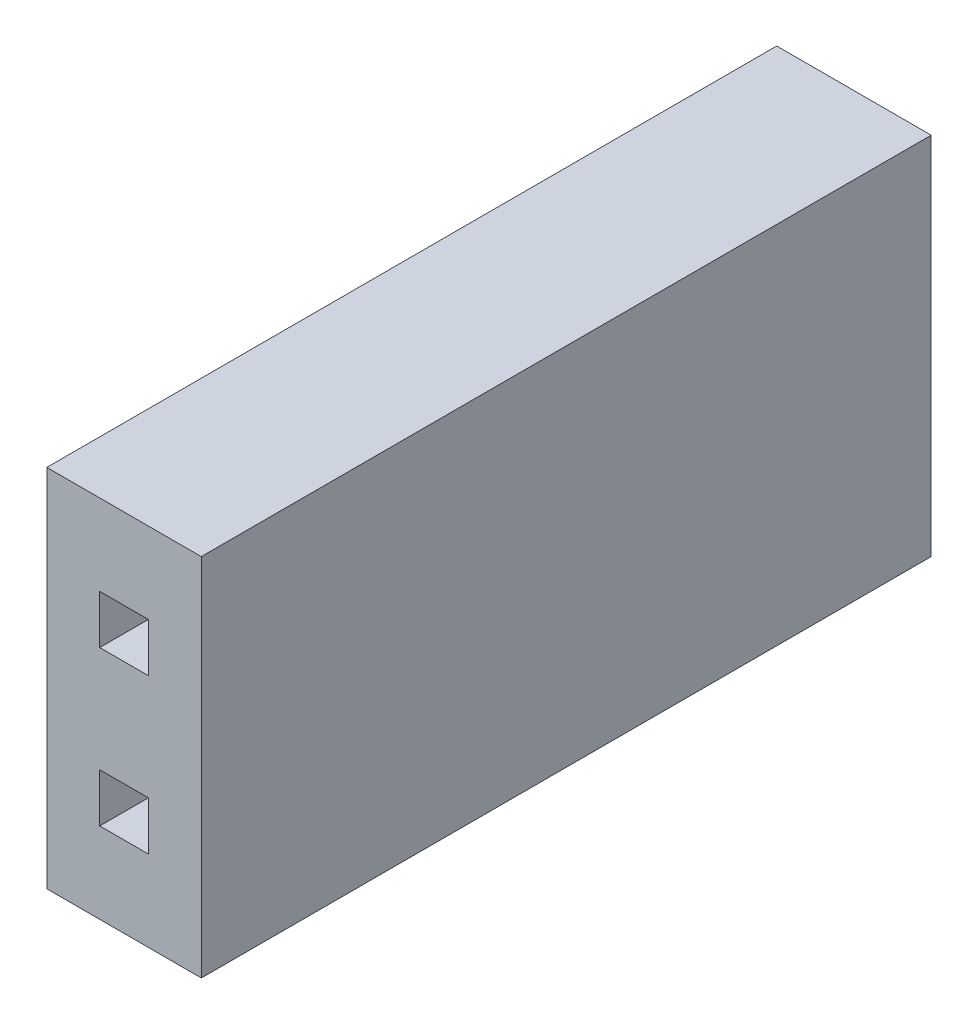
ISO-10303-21;
HEADER;
FILE_DESCRIPTION(('STEP AP214'),'2;1');
FILE_NAME('part.step','',(''),(''),'','','');
FILE_SCHEMA(('AUTOMOTIVE_DESIGN { 1 0 10303 214 1 1 1 1 }'));
ENDSEC;
DATA;
#1=APPLICATION_CONTEXT('core data for automotive mechanical design processes');
#2=APPLICATION_PROTOCOL_DEFINITION('international standard','automotive_design',2000,#1);
#3=PRODUCT_CONTEXT('',#1,'mechanical');
#4=PRODUCT('Part','Part','',(#3));
#5=PRODUCT_RELATED_PRODUCT_CATEGORY('part','',(#4));
#6=PRODUCT_DEFINITION_FORMATION('','',#4);
#7=PRODUCT_DEFINITION_CONTEXT('part definition',#1,'design');
#8=PRODUCT_DEFINITION('design','',#6,#7);
#9=PRODUCT_DEFINITION_SHAPE('','',#8);
#10=(LENGTH_UNIT() NAMED_UNIT(*) SI_UNIT(.MILLI.,.METRE.));
#11=(NAMED_UNIT(*) PLANE_ANGLE_UNIT() SI_UNIT($,.RADIAN.));
#12=(NAMED_UNIT(*) SI_UNIT($,.STERADIAN.) SOLID_ANGLE_UNIT());
#13=UNCERTAINTY_MEASURE_WITH_UNIT(LENGTH_MEASURE(1.E-05),#10,'distance_accuracy_value','');
#14=(GEOMETRIC_REPRESENTATION_CONTEXT(3) GLOBAL_UNCERTAINTY_ASSIGNED_CONTEXT((#13)) GLOBAL_UNIT_ASSIGNED_CONTEXT((#10,
#11,#12)) REPRESENTATION_CONTEXT('',''));
#15=CARTESIAN_POINT('',(0.,0.,0.));
#16=DIRECTION('',(0.,0.,1.));
#17=DIRECTION('',(1.,0.,0.));
#18=AXIS2_PLACEMENT_3D('',#15,#16,#17);
#19=CARTESIAN_POINT('',(0.,0.,12.));
#20=DIRECTION('',(1.,0.,0.));
#21=DIRECTION('',(0.,0.,-1.));
#22=AXIS2_PLACEMENT_3D('',#19,#20,#21);
#23=PLANE('',#22);
#24=DIRECTION('',(0.,-1.,0.));
#25=VECTOR('',#24,1.);
#26=CARTESIAN_POINT('',(0.,0.,0.));
#27=LINE('',#26,#25);
#28=CARTESIAN_POINT('',(0.,6.,0.));
#29=VERTEX_POINT('',#28);
#30=CARTESIAN_POINT('',(0.,0.,0.));
#31=VERTEX_POINT('',#30);
#32=EDGE_CURVE('E278',#29,#31,#27,.T.);
#33=ORIENTED_EDGE('',*,*,#32,.T.);
#34=DIRECTION('',(0.,0.,-1.));
#35=VECTOR('',#34,1.);
#36=CARTESIAN_POINT('',(0.,0.,12.));
#37=LINE('',#36,#35);
#38=CARTESIAN_POINT('',(0.,0.,12.));
#39=VERTEX_POINT('',#38);
#40=EDGE_CURVE('E11',#39,#31,#37,.T.);
#41=ORIENTED_EDGE('',*,*,#40,.F.);
#42=DIRECTION('',(0.,-1.,0.));
#43=VECTOR('',#42,1.);
#44=CARTESIAN_POINT('',(0.,0.,12.));
#45=LINE('',#44,#43);
#46=CARTESIAN_POINT('',(0.,6.,12.));
#47=VERTEX_POINT('',#46);
#48=EDGE_CURVE('E315',#47,#39,#45,.T.);
#49=ORIENTED_EDGE('',*,*,#48,.F.);
#50=DIRECTION('',(0.,0.,-1.));
#51=VECTOR('',#50,1.);
#52=CARTESIAN_POINT('',(0.,6.,12.));
#53=LINE('',#52,#51);
#54=EDGE_CURVE('E325',#47,#29,#53,.T.);
#55=ORIENTED_EDGE('',*,*,#54,.T.);
#56=EDGE_LOOP('',(#33,#41,#49,#55));
#57=FACE_BOUND('',#56,.T.);
#58=ADVANCED_FACE('F34',(#57),#23,.F.);
#59=CARTESIAN_POINT('',(0.,0.,12.));
#60=DIRECTION('',(0.,1.,0.));
#61=DIRECTION('',(0.,0.,1.));
#62=AXIS2_PLACEMENT_3D('',#59,#60,#61);
#63=PLANE('',#62);
#64=DIRECTION('',(1.,0.,0.));
#65=VECTOR('',#64,1.);
#66=CARTESIAN_POINT('',(0.,0.,0.));
#67=LINE('',#66,#65);
#68=CARTESIAN_POINT('',(2.54,0.,0.));
#69=VERTEX_POINT('',#68);
#70=EDGE_CURVE('E328',#31,#69,#67,.T.);
#71=ORIENTED_EDGE('',*,*,#70,.T.);
#72=DIRECTION('',(0.,0.,-1.));
#73=VECTOR('',#72,1.);
#74=CARTESIAN_POINT('',(2.54,0.,12.));
#75=LINE('',#74,#73);
#76=CARTESIAN_POINT('',(2.54,0.,12.));
#77=VERTEX_POINT('',#76);
#78=EDGE_CURVE('E41',#77,#69,#75,.T.);
#79=ORIENTED_EDGE('',*,*,#78,.F.);
#80=DIRECTION('',(1.,0.,0.));
#81=VECTOR('',#80,1.);
#82=CARTESIAN_POINT('',(0.,0.,12.));
#83=LINE('',#82,#81);
#84=EDGE_CURVE('E318',#39,#77,#83,.T.);
#85=ORIENTED_EDGE('',*,*,#84,.F.);
#86=ORIENTED_EDGE('',*,*,#40,.T.);
#87=EDGE_LOOP('',(#71,#79,#85,#86));
#88=FACE_BOUND('',#87,.T.);
#89=ADVANCED_FACE('F358',(#88),#63,.F.);
#90=CARTESIAN_POINT('',(2.54,0.,12.));
#91=DIRECTION('',(-1.,0.,0.));
#92=DIRECTION('',(0.,0.,1.));
#93=AXIS2_PLACEMENT_3D('',#90,#91,#92);
#94=PLANE('',#93);
#95=DIRECTION('',(0.,1.,0.));
#96=VECTOR('',#95,1.);
#97=CARTESIAN_POINT('',(2.54,0.,0.));
#98=LINE('',#97,#96);
#99=CARTESIAN_POINT('',(2.54,6.,0.));
#100=VERTEX_POINT('',#99);
#101=EDGE_CURVE('E330',#69,#100,#98,.T.);
#102=ORIENTED_EDGE('',*,*,#101,.T.);
#103=DIRECTION('',(0.,0.,-1.));
#104=VECTOR('',#103,1.);
#105=CARTESIAN_POINT('',(2.54,6.,12.));
#106=LINE('',#105,#104);
#107=CARTESIAN_POINT('',(2.54,6.,12.));
#108=VERTEX_POINT('',#107);
#109=EDGE_CURVE('E335',#108,#100,#106,.T.);
#110=ORIENTED_EDGE('',*,*,#109,.F.);
#111=DIRECTION('',(0.,1.,0.));
#112=VECTOR('',#111,1.);
#113=CARTESIAN_POINT('',(2.54,0.,12.));
#114=LINE('',#113,#112);
#115=EDGE_CURVE('E321',#77,#108,#114,.T.);
#116=ORIENTED_EDGE('',*,*,#115,.F.);
#117=ORIENTED_EDGE('',*,*,#78,.T.);
#118=EDGE_LOOP('',(#102,#110,#116,#117));
#119=FACE_BOUND('',#118,.T.);
#120=ADVANCED_FACE('F342',(#119),#94,.F.);
#121=CARTESIAN_POINT('',(0.,6.,12.));
#122=DIRECTION('',(0.,-1.,0.));
#123=DIRECTION('',(0.,0.,-1.));
#124=AXIS2_PLACEMENT_3D('',#121,#122,#123);
#125=PLANE('',#124);
#126=DIRECTION('',(-1.,0.,0.));
#127=VECTOR('',#126,1.);
#128=CARTESIAN_POINT('',(0.,6.,0.));
#129=LINE('',#128,#127);
#130=EDGE_CURVE('E319',#100,#29,#129,.T.);
#131=ORIENTED_EDGE('',*,*,#130,.T.);
#132=ORIENTED_EDGE('',*,*,#54,.F.);
#133=DIRECTION('',(-1.,0.,0.));
#134=VECTOR('',#133,1.);
#135=CARTESIAN_POINT('',(0.,6.,12.));
#136=LINE('',#135,#134);
#137=EDGE_CURVE('E323',#108,#47,#136,.T.);
#138=ORIENTED_EDGE('',*,*,#137,.F.);
#139=ORIENTED_EDGE('',*,*,#109,.T.);
#140=EDGE_LOOP('',(#131,#132,#138,#139));
#141=FACE_BOUND('',#140,.T.);
#142=ADVANCED_FACE('F351',(#141),#125,.F.);
#143=CARTESIAN_POINT('',(0.,0.,12.));
#144=DIRECTION('',(0.,0.,-1.));
#145=DIRECTION('',(-1.,0.,0.));
#146=AXIS2_PLACEMENT_3D('',#143,#144,#145);
#147=PLANE('',#146);
#148=DIRECTION('',(-1.,0.,0.));
#149=VECTOR('',#148,1.);
#150=CARTESIAN_POINT('',(0.87,4.67,12.));
#151=LINE('',#150,#149);
#152=CARTESIAN_POINT('',(1.67,4.67,12.));
#153=VERTEX_POINT('',#152);
#154=CARTESIAN_POINT('',(0.87,4.67,12.));
#155=VERTEX_POINT('',#154);
#156=EDGE_CURVE('E199',#153,#155,#151,.T.);
#157=ORIENTED_EDGE('',*,*,#156,.F.);
#158=DIRECTION('',(0.,1.,0.));
#159=VECTOR('',#158,1.);
#160=CARTESIAN_POINT('',(1.67,3.87,12.));
#161=LINE('',#160,#159);
#162=CARTESIAN_POINT('',(1.67,3.87,12.));
#163=VERTEX_POINT('',#162);
#164=EDGE_CURVE('E48',#163,#153,#161,.T.);
#165=ORIENTED_EDGE('',*,*,#164,.F.);
#166=DIRECTION('',(1.,0.,0.));
#167=VECTOR('',#166,1.);
#168=CARTESIAN_POINT('',(0.87,3.87,12.));
#169=LINE('',#168,#167);
#170=CARTESIAN_POINT('',(0.87,3.87,12.));
#171=VERTEX_POINT('',#170);
#172=EDGE_CURVE('E190',#171,#163,#169,.T.);
#173=ORIENTED_EDGE('',*,*,#172,.F.);
#174=DIRECTION('',(0.,-1.,0.));
#175=VECTOR('',#174,1.);
#176=CARTESIAN_POINT('',(0.87,3.87,12.));
#177=LINE('',#176,#175);
#178=EDGE_CURVE('E193',#155,#171,#177,.T.);
#179=ORIENTED_EDGE('',*,*,#178,.F.);
#180=EDGE_LOOP('',(#157,#165,#173,#179));
#181=FACE_BOUND('',#180,.T.);
#182=DIRECTION('',(-1.,0.,0.));
#183=VECTOR('',#182,1.);
#184=CARTESIAN_POINT('',(0.87,2.13,12.));
#185=LINE('',#184,#183);
#186=CARTESIAN_POINT('',(1.67,2.13,12.));
#187=VERTEX_POINT('',#186);
#188=CARTESIAN_POINT('',(0.87,2.13,12.));
#189=VERTEX_POINT('',#188);
#190=EDGE_CURVE('E225',#187,#189,#185,.T.);
#191=ORIENTED_EDGE('',*,*,#190,.F.);
#192=DIRECTION('',(0.,1.,0.));
#193=VECTOR('',#192,1.);
#194=CARTESIAN_POINT('',(1.67,1.33,12.));
#195=LINE('',#194,#193);
#196=CARTESIAN_POINT('',(1.67,1.33,12.));
#197=VERTEX_POINT('',#196);
#198=EDGE_CURVE('E56',#197,#187,#195,.T.);
#199=ORIENTED_EDGE('',*,*,#198,.F.);
#200=DIRECTION('',(1.,0.,0.));
#201=VECTOR('',#200,1.);
#202=CARTESIAN_POINT('',(0.87,1.33,12.));
#203=LINE('',#202,#201);
#204=CARTESIAN_POINT('',(0.87,1.33,12.));
#205=VERTEX_POINT('',#204);
#206=EDGE_CURVE('E214',#205,#197,#203,.T.);
#207=ORIENTED_EDGE('',*,*,#206,.F.);
#208=DIRECTION('',(0.,-1.,0.));
#209=VECTOR('',#208,1.);
#210=CARTESIAN_POINT('',(0.87,1.33,12.));
#211=LINE('',#210,#209);
#212=EDGE_CURVE('E228',#189,#205,#211,.T.);
#213=ORIENTED_EDGE('',*,*,#212,.F.);
#214=EDGE_LOOP('',(#191,#199,#207,#213));
#215=FACE_BOUND('',#214,.T.);
#216=ORIENTED_EDGE('',*,*,#48,.T.);
#217=ORIENTED_EDGE('',*,*,#84,.T.);
#218=ORIENTED_EDGE('',*,*,#115,.T.);
#219=ORIENTED_EDGE('',*,*,#137,.T.);
#220=EDGE_LOOP('',(#216,#217,#218,#219));
#221=FACE_BOUND('',#220,.T.);
#222=ADVANCED_FACE('F357',(#181,#215,#221),#147,.F.);
#223=CARTESIAN_POINT('',(0.,0.,0.));
#224=DIRECTION('',(0.,0.,-1.));
#225=DIRECTION('',(-1.,0.,0.));
#226=AXIS2_PLACEMENT_3D('',#223,#224,#225);
#227=PLANE('',#226);
#228=DIRECTION('',(0.,1.,0.));
#229=VECTOR('',#228,1.);
#230=CARTESIAN_POINT('',(0.270000000000001,5.27,0.));
#231=LINE('',#230,#229);
#232=CARTESIAN_POINT('',(0.27,3.27,0.));
#233=VERTEX_POINT('',#232);
#234=CARTESIAN_POINT('',(0.270000000000001,5.27,0.));
#235=VERTEX_POINT('',#234);
#236=EDGE_CURVE('E265',#233,#235,#231,.T.);
#237=ORIENTED_EDGE('',*,*,#236,.F.);
#238=DIRECTION('',(-1.,0.,0.));
#239=VECTOR('',#238,1.);
#240=CARTESIAN_POINT('',(2.27,3.27,0.));
#241=LINE('',#240,#239);
#242=CARTESIAN_POINT('',(2.27,3.27,0.));
#243=VERTEX_POINT('',#242);
#244=EDGE_CURVE('E255',#243,#233,#241,.T.);
#245=ORIENTED_EDGE('',*,*,#244,.F.);
#246=DIRECTION('',(0.,-1.,0.));
#247=VECTOR('',#246,1.);
#248=CARTESIAN_POINT('',(2.27,5.27,0.));
#249=LINE('',#248,#247);
#250=CARTESIAN_POINT('',(2.27,5.27,0.));
#251=VERTEX_POINT('',#250);
#252=EDGE_CURVE('E271',#251,#243,#249,.T.);
#253=ORIENTED_EDGE('',*,*,#252,.F.);
#254=DIRECTION('',(1.,0.,0.));
#255=VECTOR('',#254,1.);
#256=CARTESIAN_POINT('',(2.27,5.27,0.));
#257=LINE('',#256,#255);
#258=EDGE_CURVE('E267',#235,#251,#257,.T.);
#259=ORIENTED_EDGE('',*,*,#258,.F.);
#260=EDGE_LOOP('',(#237,#245,#253,#259));
#261=FACE_BOUND('',#260,.T.);
#262=DIRECTION('',(0.,1.,0.));
#263=VECTOR('',#262,1.);
#264=CARTESIAN_POINT('',(0.27,2.73,0.));
#265=LINE('',#264,#263);
#266=CARTESIAN_POINT('',(0.27,0.73,0.));
#267=VERTEX_POINT('',#266);
#268=CARTESIAN_POINT('',(0.27,2.73,0.));
#269=VERTEX_POINT('',#268);
#270=EDGE_CURVE('E250',#267,#269,#265,.T.);
#271=ORIENTED_EDGE('',*,*,#270,.F.);
#272=DIRECTION('',(-1.,0.,0.));
#273=VECTOR('',#272,1.);
#274=CARTESIAN_POINT('',(2.27,0.73,0.));
#275=LINE('',#274,#273);
#276=CARTESIAN_POINT('',(2.27,0.73,0.));
#277=VERTEX_POINT('',#276);
#278=EDGE_CURVE('E289',#277,#267,#275,.T.);
#279=ORIENTED_EDGE('',*,*,#278,.F.);
#280=DIRECTION('',(0.,-1.,0.));
#281=VECTOR('',#280,1.);
#282=CARTESIAN_POINT('',(2.27,2.73,0.));
#283=LINE('',#282,#281);
#284=CARTESIAN_POINT('',(2.27,2.73,0.));
#285=VERTEX_POINT('',#284);
#286=EDGE_CURVE('E303',#285,#277,#283,.T.);
#287=ORIENTED_EDGE('',*,*,#286,.F.);
#288=DIRECTION('',(1.,0.,0.));
#289=VECTOR('',#288,1.);
#290=CARTESIAN_POINT('',(2.27,2.73,0.));
#291=LINE('',#290,#289);
#292=EDGE_CURVE('E300',#269,#285,#291,.T.);
#293=ORIENTED_EDGE('',*,*,#292,.F.);
#294=EDGE_LOOP('',(#271,#279,#287,#293));
#295=FACE_BOUND('',#294,.T.);
#296=ORIENTED_EDGE('',*,*,#32,.F.);
#297=ORIENTED_EDGE('',*,*,#130,.F.);
#298=ORIENTED_EDGE('',*,*,#101,.F.);
#299=ORIENTED_EDGE('',*,*,#70,.F.);
#300=EDGE_LOOP('',(#296,#297,#298,#299));
#301=FACE_BOUND('',#300,.T.);
#302=ADVANCED_FACE('F348',(#261,#295,#301),#227,.T.);
#303=CARTESIAN_POINT('',(0.27,2.73,4.));
#304=DIRECTION('',(-1.,0.,0.));
#305=DIRECTION('',(0.,-1.,0.));
#306=AXIS2_PLACEMENT_3D('',#303,#304,#305);
#307=PLANE('',#306);
#308=ORIENTED_EDGE('',*,*,#270,.T.);
#309=DIRECTION('',(0.,0.,-1.));
#310=VECTOR('',#309,1.);
#311=CARTESIAN_POINT('',(0.27,2.73,4.));
#312=LINE('',#311,#310);
#313=CARTESIAN_POINT('',(0.27,2.73,4.));
#314=VERTEX_POINT('',#313);
#315=EDGE_CURVE('E298',#314,#269,#312,.T.);
#316=ORIENTED_EDGE('',*,*,#315,.F.);
#317=DIRECTION('',(0.,1.,0.));
#318=VECTOR('',#317,1.);
#319=CARTESIAN_POINT('',(0.27,2.73,4.));
#320=LINE('',#319,#318);
#321=CARTESIAN_POINT('',(0.27,0.73,4.));
#322=VERTEX_POINT('',#321);
#323=EDGE_CURVE('E285',#322,#314,#320,.T.);
#324=ORIENTED_EDGE('',*,*,#323,.F.);
#325=DIRECTION('',(0.,0.,-1.));
#326=VECTOR('',#325,1.);
#327=CARTESIAN_POINT('',(0.27,0.73,4.));
#328=LINE('',#327,#326);
#329=EDGE_CURVE('E268',#322,#267,#328,.T.);
#330=ORIENTED_EDGE('',*,*,#329,.T.);
#331=EDGE_LOOP('',(#308,#316,#324,#330));
#332=FACE_BOUND('',#331,.T.);
#333=ADVANCED_FACE('F370',(#332),#307,.F.);
#334=CARTESIAN_POINT('',(2.27,0.73,4.));
#335=DIRECTION('',(0.,-1.,0.));
#336=DIRECTION('',(0.,0.,-1.));
#337=AXIS2_PLACEMENT_3D('',#334,#335,#336);
#338=PLANE('',#337);
#339=ORIENTED_EDGE('',*,*,#278,.T.);
#340=ORIENTED_EDGE('',*,*,#329,.F.);
#341=DIRECTION('',(-1.,0.,0.));
#342=VECTOR('',#341,1.);
#343=CARTESIAN_POINT('',(2.27,0.73,4.));
#344=LINE('',#343,#342);
#345=CARTESIAN_POINT('',(2.27,0.73,4.));
#346=VERTEX_POINT('',#345);
#347=EDGE_CURVE('E295',#346,#322,#344,.T.);
#348=ORIENTED_EDGE('',*,*,#347,.F.);
#349=DIRECTION('',(0.,0.,-1.));
#350=VECTOR('',#349,1.);
#351=CARTESIAN_POINT('',(2.27,0.73,4.));
#352=LINE('',#351,#350);
#353=EDGE_CURVE('E309',#346,#277,#352,.T.);
#354=ORIENTED_EDGE('',*,*,#353,.T.);
#355=EDGE_LOOP('',(#339,#340,#348,#354));
#356=FACE_BOUND('',#355,.T.);
#357=ADVANCED_FACE('F377',(#356),#338,.F.);
#358=CARTESIAN_POINT('',(2.27,2.73,4.));
#359=DIRECTION('',(1.,0.,0.));
#360=DIRECTION('',(0.,1.,0.));
#361=AXIS2_PLACEMENT_3D('',#358,#359,#360);
#362=PLANE('',#361);
#363=ORIENTED_EDGE('',*,*,#286,.T.);
#364=ORIENTED_EDGE('',*,*,#353,.F.);
#365=DIRECTION('',(0.,-1.,0.));
#366=VECTOR('',#365,1.);
#367=CARTESIAN_POINT('',(2.27,2.73,4.));
#368=LINE('',#367,#366);
#369=CARTESIAN_POINT('',(2.27,2.73,4.));
#370=VERTEX_POINT('',#369);
#371=EDGE_CURVE('E292',#370,#346,#368,.T.);
#372=ORIENTED_EDGE('',*,*,#371,.F.);
#373=DIRECTION('',(0.,0.,-1.));
#374=VECTOR('',#373,1.);
#375=CARTESIAN_POINT('',(2.27,2.73,4.));
#376=LINE('',#375,#374);
#377=EDGE_CURVE('E311',#370,#285,#376,.T.);
#378=ORIENTED_EDGE('',*,*,#377,.T.);
#379=EDGE_LOOP('',(#363,#364,#372,#378));
#380=FACE_BOUND('',#379,.T.);
#381=ADVANCED_FACE('F383',(#380),#362,.F.);
#382=CARTESIAN_POINT('',(2.27,2.73,4.));
#383=DIRECTION('',(0.,1.,0.));
#384=DIRECTION('',(0.,0.,1.));
#385=AXIS2_PLACEMENT_3D('',#382,#383,#384);
#386=PLANE('',#385);
#387=ORIENTED_EDGE('',*,*,#292,.T.);
#388=ORIENTED_EDGE('',*,*,#377,.F.);
#389=DIRECTION('',(1.,0.,0.));
#390=VECTOR('',#389,1.);
#391=CARTESIAN_POINT('',(2.27,2.73,4.));
#392=LINE('',#391,#390);
#393=EDGE_CURVE('E288',#314,#370,#392,.T.);
#394=ORIENTED_EDGE('',*,*,#393,.F.);
#395=ORIENTED_EDGE('',*,*,#315,.T.);
#396=EDGE_LOOP('',(#387,#388,#394,#395));
#397=FACE_BOUND('',#396,.T.);
#398=ADVANCED_FACE('F379',(#397),#386,.F.);
#399=CARTESIAN_POINT('',(0.,0.,4.));
#400=DIRECTION('',(0.,0.,-1.));
#401=DIRECTION('',(-1.,0.,0.));
#402=AXIS2_PLACEMENT_3D('',#399,#400,#401);
#403=PLANE('',#402);
#404=CARTESIAN_POINT('',(1.27,1.73,4.));
#405=DIRECTION('',(0.,0.,-1.));
#406=DIRECTION('',(-1.,0.,0.));
#407=AXIS2_PLACEMENT_3D('',#404,#405,#406);
#408=CIRCLE('',#407,0.65);
#409=CARTESIAN_POINT('',(0.62,1.73,4.));
#410=VERTEX_POINT('',#409);
#411=EDGE_CURVE('E244',#410,#410,#408,.T.);
#412=ORIENTED_EDGE('',*,*,#411,.F.);
#413=EDGE_LOOP('',(#412));
#414=FACE_BOUND('',#413,.T.);
#415=ORIENTED_EDGE('',*,*,#323,.T.);
#416=ORIENTED_EDGE('',*,*,#393,.T.);
#417=ORIENTED_EDGE('',*,*,#371,.T.);
#418=ORIENTED_EDGE('',*,*,#347,.T.);
#419=EDGE_LOOP('',(#415,#416,#417,#418));
#420=FACE_BOUND('',#419,.T.);
#421=ADVANCED_FACE('F382',(#414,#420),#403,.T.);
#422=CARTESIAN_POINT('',(0.270000000000001,5.27,4.));
#423=DIRECTION('',(-1.,0.,0.));
#424=DIRECTION('',(0.,-1.,0.));
#425=AXIS2_PLACEMENT_3D('',#422,#423,#424);
#426=PLANE('',#425);
#427=ORIENTED_EDGE('',*,*,#236,.T.);
#428=DIRECTION('',(0.,0.,-1.));
#429=VECTOR('',#428,1.);
#430=CARTESIAN_POINT('',(0.270000000000001,5.27,4.));
#431=LINE('',#430,#429);
#432=CARTESIAN_POINT('',(0.270000000000001,5.27,4.));
#433=VERTEX_POINT('',#432);
#434=EDGE_CURVE('E264',#433,#235,#431,.T.);
#435=ORIENTED_EDGE('',*,*,#434,.F.);
#436=DIRECTION('',(0.,1.,0.));
#437=VECTOR('',#436,1.);
#438=CARTESIAN_POINT('',(0.270000000000001,5.27,4.));
#439=LINE('',#438,#437);
#440=CARTESIAN_POINT('',(0.27,3.27,4.));
#441=VERTEX_POINT('',#440);
#442=EDGE_CURVE('E251',#441,#433,#439,.T.);
#443=ORIENTED_EDGE('',*,*,#442,.F.);
#444=DIRECTION('',(0.,0.,-1.));
#445=VECTOR('',#444,1.);
#446=CARTESIAN_POINT('',(0.27,3.27,4.));
#447=LINE('',#446,#445);
#448=EDGE_CURVE('E276',#441,#233,#447,.T.);
#449=ORIENTED_EDGE('',*,*,#448,.T.);
#450=EDGE_LOOP('',(#427,#435,#443,#449));
#451=FACE_BOUND('',#450,.T.);
#452=ADVANCED_FACE('F393',(#451),#426,.F.);
#453=CARTESIAN_POINT('',(2.27,3.27,4.));
#454=DIRECTION('',(0.,-1.,0.));
#455=DIRECTION('',(0.,0.,-1.));
#456=AXIS2_PLACEMENT_3D('',#453,#454,#455);
#457=PLANE('',#456);
#458=ORIENTED_EDGE('',*,*,#244,.T.);
#459=ORIENTED_EDGE('',*,*,#448,.F.);
#460=DIRECTION('',(-1.,0.,0.));
#461=VECTOR('',#460,1.);
#462=CARTESIAN_POINT('',(2.27,3.27,4.));
#463=LINE('',#462,#461);
#464=CARTESIAN_POINT('',(2.27,3.27,4.));
#465=VERTEX_POINT('',#464);
#466=EDGE_CURVE('E261',#465,#441,#463,.T.);
#467=ORIENTED_EDGE('',*,*,#466,.F.);
#468=DIRECTION('',(0.,0.,-1.));
#469=VECTOR('',#468,1.);
#470=CARTESIAN_POINT('',(2.27,3.27,4.));
#471=LINE('',#470,#469);
#472=EDGE_CURVE('E279',#465,#243,#471,.T.);
#473=ORIENTED_EDGE('',*,*,#472,.T.);
#474=EDGE_LOOP('',(#458,#459,#467,#473));
#475=FACE_BOUND('',#474,.T.);
#476=ADVANCED_FACE('F397',(#475),#457,.F.);
#477=CARTESIAN_POINT('',(2.27,5.27,4.));
#478=DIRECTION('',(1.,0.,0.));
#479=DIRECTION('',(0.,0.,-1.));
#480=AXIS2_PLACEMENT_3D('',#477,#478,#479);
#481=PLANE('',#480);
#482=ORIENTED_EDGE('',*,*,#252,.T.);
#483=ORIENTED_EDGE('',*,*,#472,.F.);
#484=DIRECTION('',(0.,-1.,0.));
#485=VECTOR('',#484,1.);
#486=CARTESIAN_POINT('',(2.27,5.27,4.));
#487=LINE('',#486,#485);
#488=CARTESIAN_POINT('',(2.27,5.27,4.));
#489=VERTEX_POINT('',#488);
#490=EDGE_CURVE('E258',#489,#465,#487,.T.);
#491=ORIENTED_EDGE('',*,*,#490,.F.);
#492=DIRECTION('',(0.,0.,-1.));
#493=VECTOR('',#492,1.);
#494=CARTESIAN_POINT('',(2.27,5.27,4.));
#495=LINE('',#494,#493);
#496=EDGE_CURVE('E281',#489,#251,#495,.T.);
#497=ORIENTED_EDGE('',*,*,#496,.T.);
#498=EDGE_LOOP('',(#482,#483,#491,#497));
#499=FACE_BOUND('',#498,.T.);
#500=ADVANCED_FACE('F403',(#499),#481,.F.);
#501=CARTESIAN_POINT('',(2.27,5.27,4.));
#502=DIRECTION('',(0.,1.,0.));
#503=DIRECTION('',(0.,0.,1.));
#504=AXIS2_PLACEMENT_3D('',#501,#502,#503);
#505=PLANE('',#504);
#506=ORIENTED_EDGE('',*,*,#258,.T.);
#507=ORIENTED_EDGE('',*,*,#496,.F.);
#508=DIRECTION('',(1.,0.,0.));
#509=VECTOR('',#508,1.);
#510=CARTESIAN_POINT('',(2.27,5.27,4.));
#511=LINE('',#510,#509);
#512=EDGE_CURVE('E254',#433,#489,#511,.T.);
#513=ORIENTED_EDGE('',*,*,#512,.F.);
#514=ORIENTED_EDGE('',*,*,#434,.T.);
#515=EDGE_LOOP('',(#506,#507,#513,#514));
#516=FACE_BOUND('',#515,.T.);
#517=ADVANCED_FACE('F399',(#516),#505,.F.);
#518=CARTESIAN_POINT('',(0.,0.,4.));
#519=DIRECTION('',(0.,0.,-1.));
#520=DIRECTION('',(-1.,0.,0.));
#521=AXIS2_PLACEMENT_3D('',#518,#519,#520);
#522=PLANE('',#521);
#523=CARTESIAN_POINT('',(1.27,4.27,4.));
#524=DIRECTION('',(0.,0.,-1.));
#525=DIRECTION('',(-1.,0.,0.));
#526=AXIS2_PLACEMENT_3D('',#523,#524,#525);
#527=CIRCLE('',#526,0.65);
#528=CARTESIAN_POINT('',(0.62,4.27,4.));
#529=VERTEX_POINT('',#528);
#530=EDGE_CURVE('E206',#529,#529,#527,.T.);
#531=ORIENTED_EDGE('',*,*,#530,.F.);
#532=EDGE_LOOP('',(#531));
#533=FACE_BOUND('',#532,.T.);
#534=ORIENTED_EDGE('',*,*,#442,.T.);
#535=ORIENTED_EDGE('',*,*,#512,.T.);
#536=ORIENTED_EDGE('',*,*,#490,.T.);
#537=ORIENTED_EDGE('',*,*,#466,.T.);
#538=EDGE_LOOP('',(#534,#535,#536,#537));
#539=FACE_BOUND('',#538,.T.);
#540=ADVANCED_FACE('F402',(#533,#539),#522,.T.);
#541=CARTESIAN_POINT('',(1.27,1.73,-1.83847763108502));
#542=DIRECTION('',(0.,0.,1.));
#543=DIRECTION('',(1.,0.,0.));
#544=AXIS2_PLACEMENT_3D('',#541,#542,#543);
#545=CYLINDRICAL_SURFACE('',#544,0.65);
#546=ORIENTED_EDGE('',*,*,#411,.T.);
#547=EDGE_LOOP('',(#546));
#548=FACE_BOUND('',#547,.T.);
#549=CARTESIAN_POINT('',(1.27,1.73,0.));
#550=DIRECTION('',(0.,0.,-1.));
#551=DIRECTION('',(-1.,0.,0.));
#552=AXIS2_PLACEMENT_3D('',#549,#550,#551);
#553=CIRCLE('',#552,0.65);
#554=CARTESIAN_POINT('',(0.62,1.73,0.));
#555=VERTEX_POINT('',#554);
#556=EDGE_CURVE('E247',#555,#555,#553,.T.);
#557=ORIENTED_EDGE('',*,*,#556,.F.);
#558=EDGE_LOOP('',(#557));
#559=FACE_BOUND('',#558,.T.);
#560=ADVANCED_FACE('F413',(#548,#559),#545,.T.);
#561=CARTESIAN_POINT('',(0.,0.,0.));
#562=DIRECTION('',(0.,0.,-1.));
#563=DIRECTION('',(-1.,0.,0.));
#564=AXIS2_PLACEMENT_3D('',#561,#562,#563);
#565=PLANE('',#564);
#566=ORIENTED_EDGE('',*,*,#556,.T.);
#567=EDGE_LOOP('',(#566));
#568=FACE_BOUND('',#567,.T.);
#569=ADVANCED_FACE('F415',(#568),#565,.T.);
#570=CARTESIAN_POINT('',(1.27,4.27,-1.83847763108502));
#571=DIRECTION('',(0.,0.,1.));
#572=DIRECTION('',(1.,0.,0.));
#573=AXIS2_PLACEMENT_3D('',#570,#571,#572);
#574=CYLINDRICAL_SURFACE('',#573,0.65);
#575=ORIENTED_EDGE('',*,*,#530,.T.);
#576=EDGE_LOOP('',(#575));
#577=FACE_BOUND('',#576,.T.);
#578=CARTESIAN_POINT('',(1.27,4.27,0.));
#579=DIRECTION('',(0.,0.,-1.));
#580=DIRECTION('',(-1.,0.,0.));
#581=AXIS2_PLACEMENT_3D('',#578,#579,#580);
#582=CIRCLE('',#581,0.65);
#583=CARTESIAN_POINT('',(0.62,4.27,0.));
#584=VERTEX_POINT('',#583);
#585=EDGE_CURVE('E241',#584,#584,#582,.T.);
#586=ORIENTED_EDGE('',*,*,#585,.F.);
#587=EDGE_LOOP('',(#586));
#588=FACE_BOUND('',#587,.T.);
#589=ADVANCED_FACE('F418',(#577,#588),#574,.T.);
#590=CARTESIAN_POINT('',(0.,0.,0.));
#591=DIRECTION('',(0.,0.,-1.));
#592=DIRECTION('',(-1.,0.,0.));
#593=AXIS2_PLACEMENT_3D('',#590,#591,#592);
#594=PLANE('',#593);
#595=ORIENTED_EDGE('',*,*,#585,.T.);
#596=EDGE_LOOP('',(#595));
#597=FACE_BOUND('',#596,.T.);
#598=ADVANCED_FACE('F423',(#597),#594,.T.);
#599=CARTESIAN_POINT('',(1.67,1.33,7.));
#600=DIRECTION('',(1.,0.,0.));
#601=DIRECTION('',(0.,0.,-1.));
#602=AXIS2_PLACEMENT_3D('',#599,#600,#601);
#603=PLANE('',#602);
#604=ORIENTED_EDGE('',*,*,#198,.T.);
#605=DIRECTION('',(0.,0.,1.));
#606=VECTOR('',#605,1.);
#607=CARTESIAN_POINT('',(1.67,2.13,7.));
#608=LINE('',#607,#606);
#609=CARTESIAN_POINT('',(1.67,2.13,7.));
#610=VERTEX_POINT('',#609);
#611=EDGE_CURVE('E223',#610,#187,#608,.T.);
#612=ORIENTED_EDGE('',*,*,#611,.F.);
#613=DIRECTION('',(0.,1.,0.));
#614=VECTOR('',#613,1.);
#615=CARTESIAN_POINT('',(1.67,1.33,7.));
#616=LINE('',#615,#614);
#617=CARTESIAN_POINT('',(1.67,1.33,7.));
#618=VERTEX_POINT('',#617);
#619=EDGE_CURVE('E210',#618,#610,#616,.T.);
#620=ORIENTED_EDGE('',*,*,#619,.F.);
#621=DIRECTION('',(0.,0.,1.));
#622=VECTOR('',#621,1.);
#623=CARTESIAN_POINT('',(1.67,1.33,7.));
#624=LINE('',#623,#622);
#625=EDGE_CURVE('E200',#618,#197,#624,.T.);
#626=ORIENTED_EDGE('',*,*,#625,.T.);
#627=EDGE_LOOP('',(#604,#612,#620,#626));
#628=FACE_BOUND('',#627,.T.);
#629=ADVANCED_FACE('F426',(#628),#603,.F.);
#630=CARTESIAN_POINT('',(0.87,1.33,7.));
#631=DIRECTION('',(0.,-1.,0.));
#632=DIRECTION('',(0.,0.,-1.));
#633=AXIS2_PLACEMENT_3D('',#630,#631,#632);
#634=PLANE('',#633);
#635=ORIENTED_EDGE('',*,*,#206,.T.);
#636=ORIENTED_EDGE('',*,*,#625,.F.);
#637=DIRECTION('',(1.,0.,0.));
#638=VECTOR('',#637,1.);
#639=CARTESIAN_POINT('',(0.87,1.33,7.));
#640=LINE('',#639,#638);
#641=CARTESIAN_POINT('',(0.87,1.33,7.));
#642=VERTEX_POINT('',#641);
#643=EDGE_CURVE('E220',#642,#618,#640,.T.);
#644=ORIENTED_EDGE('',*,*,#643,.F.);
#645=DIRECTION('',(0.,0.,1.));
#646=VECTOR('',#645,1.);
#647=CARTESIAN_POINT('',(0.87,1.33,7.));
#648=LINE('',#647,#646);
#649=EDGE_CURVE('E234',#642,#205,#648,.T.);
#650=ORIENTED_EDGE('',*,*,#649,.T.);
#651=EDGE_LOOP('',(#635,#636,#644,#650));
#652=FACE_BOUND('',#651,.T.);
#653=ADVANCED_FACE('F433',(#652),#634,.F.);
#654=CARTESIAN_POINT('',(0.87,1.33,7.));
#655=DIRECTION('',(-1.,0.,0.));
#656=DIRECTION('',(0.,0.,1.));
#657=AXIS2_PLACEMENT_3D('',#654,#655,#656);
#658=PLANE('',#657);
#659=ORIENTED_EDGE('',*,*,#212,.T.);
#660=ORIENTED_EDGE('',*,*,#649,.F.);
#661=DIRECTION('',(0.,-1.,0.));
#662=VECTOR('',#661,1.);
#663=CARTESIAN_POINT('',(0.87,1.33,7.));
#664=LINE('',#663,#662);
#665=CARTESIAN_POINT('',(0.87,2.13,7.));
#666=VERTEX_POINT('',#665);
#667=EDGE_CURVE('E217',#666,#642,#664,.T.);
#668=ORIENTED_EDGE('',*,*,#667,.F.);
#669=DIRECTION('',(0.,0.,1.));
#670=VECTOR('',#669,1.);
#671=CARTESIAN_POINT('',(0.87,2.13,7.));
#672=LINE('',#671,#670);
#673=EDGE_CURVE('E236',#666,#189,#672,.T.);
#674=ORIENTED_EDGE('',*,*,#673,.T.);
#675=EDGE_LOOP('',(#659,#660,#668,#674));
#676=FACE_BOUND('',#675,.T.);
#677=ADVANCED_FACE('F438',(#676),#658,.F.);
#678=CARTESIAN_POINT('',(0.87,2.13,7.));
#679=DIRECTION('',(0.,1.,0.));
#680=DIRECTION('',(0.,0.,1.));
#681=AXIS2_PLACEMENT_3D('',#678,#679,#680);
#682=PLANE('',#681);
#683=ORIENTED_EDGE('',*,*,#190,.T.);
#684=ORIENTED_EDGE('',*,*,#673,.F.);
#685=DIRECTION('',(-1.,0.,0.));
#686=VECTOR('',#685,1.);
#687=CARTESIAN_POINT('',(0.87,2.13,7.));
#688=LINE('',#687,#686);
#689=EDGE_CURVE('E213',#610,#666,#688,.T.);
#690=ORIENTED_EDGE('',*,*,#689,.F.);
#691=ORIENTED_EDGE('',*,*,#611,.T.);
#692=EDGE_LOOP('',(#683,#684,#690,#691));
#693=FACE_BOUND('',#692,.T.);
#694=ADVANCED_FACE('F434',(#693),#682,.F.);
#695=CARTESIAN_POINT('',(0.,0.,7.));
#696=DIRECTION('',(0.,0.,-1.));
#697=DIRECTION('',(-1.,0.,0.));
#698=AXIS2_PLACEMENT_3D('',#695,#696,#697);
#699=PLANE('',#698);
#700=ORIENTED_EDGE('',*,*,#619,.T.);
#701=ORIENTED_EDGE('',*,*,#689,.T.);
#702=ORIENTED_EDGE('',*,*,#667,.T.);
#703=ORIENTED_EDGE('',*,*,#643,.T.);
#704=EDGE_LOOP('',(#700,#701,#702,#703));
#705=FACE_BOUND('',#704,.T.);
#706=ADVANCED_FACE('F437',(#705),#699,.F.);
#707=CARTESIAN_POINT('',(1.67,3.87,7.));
#708=DIRECTION('',(1.,0.,0.));
#709=DIRECTION('',(0.,0.,-1.));
#710=AXIS2_PLACEMENT_3D('',#707,#708,#709);
#711=PLANE('',#710);
#712=ORIENTED_EDGE('',*,*,#164,.T.);
#713=DIRECTION('',(0.,0.,1.));
#714=VECTOR('',#713,1.);
#715=CARTESIAN_POINT('',(1.67,4.67,7.));
#716=LINE('',#715,#714);
#717=CARTESIAN_POINT('',(1.67,4.67,7.));
#718=VERTEX_POINT('',#717);
#719=EDGE_CURVE('E168',#718,#153,#716,.T.);
#720=ORIENTED_EDGE('',*,*,#719,.F.);
#721=DIRECTION('',(0.,1.,0.));
#722=VECTOR('',#721,1.);
#723=CARTESIAN_POINT('',(1.67,3.87,7.));
#724=LINE('',#723,#722);
#725=CARTESIAN_POINT('',(1.67,3.87,7.));
#726=VERTEX_POINT('',#725);
#727=EDGE_CURVE('E172',#726,#718,#724,.T.);
#728=ORIENTED_EDGE('',*,*,#727,.F.);
#729=DIRECTION('',(0.,0.,1.));
#730=VECTOR('',#729,1.);
#731=CARTESIAN_POINT('',(1.67,3.87,7.));
#732=LINE('',#731,#730);
#733=EDGE_CURVE('E204',#726,#163,#732,.T.);
#734=ORIENTED_EDGE('',*,*,#733,.T.);
#735=EDGE_LOOP('',(#712,#720,#728,#734));
#736=FACE_BOUND('',#735,.T.);
#737=ADVANCED_FACE('F170',(#736),#711,.F.);
#738=CARTESIAN_POINT('',(0.87,3.87,7.));
#739=DIRECTION('',(0.,-1.,0.));
#740=DIRECTION('',(0.,0.,-1.));
#741=AXIS2_PLACEMENT_3D('',#738,#739,#740);
#742=PLANE('',#741);
#743=ORIENTED_EDGE('',*,*,#172,.T.);
#744=ORIENTED_EDGE('',*,*,#733,.F.);
#745=DIRECTION('',(1.,0.,0.));
#746=VECTOR('',#745,1.);
#747=CARTESIAN_POINT('',(0.87,3.87,7.));
#748=LINE('',#747,#746);
#749=CARTESIAN_POINT('',(0.87,3.87,7.));
#750=VERTEX_POINT('',#749);
#751=EDGE_CURVE('E178',#750,#726,#748,.T.);
#752=ORIENTED_EDGE('',*,*,#751,.F.);
#753=DIRECTION('',(0.,0.,1.));
#754=VECTOR('',#753,1.);
#755=CARTESIAN_POINT('',(0.87,3.87,7.));
#756=LINE('',#755,#754);
#757=EDGE_CURVE('E207',#750,#171,#756,.T.);
#758=ORIENTED_EDGE('',*,*,#757,.T.);
#759=EDGE_LOOP('',(#743,#744,#752,#758));
#760=FACE_BOUND('',#759,.T.);
#761=ADVANCED_FACE('F451',(#760),#742,.F.);
#762=CARTESIAN_POINT('',(0.87,3.87,7.));
#763=DIRECTION('',(-1.,0.,0.));
#764=DIRECTION('',(0.,0.,1.));
#765=AXIS2_PLACEMENT_3D('',#762,#763,#764);
#766=PLANE('',#765);
#767=ORIENTED_EDGE('',*,*,#178,.T.);
#768=ORIENTED_EDGE('',*,*,#757,.F.);
#769=DIRECTION('',(0.,-1.,0.));
#770=VECTOR('',#769,1.);
#771=CARTESIAN_POINT('',(0.87,3.87,7.));
#772=LINE('',#771,#770);
#773=CARTESIAN_POINT('',(0.87,4.67,7.));
#774=VERTEX_POINT('',#773);
#775=EDGE_CURVE('E186',#774,#750,#772,.T.);
#776=ORIENTED_EDGE('',*,*,#775,.F.);
#777=DIRECTION('',(0.,0.,1.));
#778=VECTOR('',#777,1.);
#779=CARTESIAN_POINT('',(0.87,4.67,7.));
#780=LINE('',#779,#778);
#781=EDGE_CURVE('E177',#774,#155,#780,.T.);
#782=ORIENTED_EDGE('',*,*,#781,.T.);
#783=EDGE_LOOP('',(#767,#768,#776,#782));
#784=FACE_BOUND('',#783,.T.);
#785=ADVANCED_FACE('F454',(#784),#766,.F.);
#786=CARTESIAN_POINT('',(0.87,4.67,7.));
#787=DIRECTION('',(0.,1.,0.));
#788=DIRECTION('',(0.,0.,1.));
#789=AXIS2_PLACEMENT_3D('',#786,#787,#788);
#790=PLANE('',#789);
#791=ORIENTED_EDGE('',*,*,#156,.T.);
#792=ORIENTED_EDGE('',*,*,#781,.F.);
#793=DIRECTION('',(-1.,0.,0.));
#794=VECTOR('',#793,1.);
#795=CARTESIAN_POINT('',(0.87,4.67,7.));
#796=LINE('',#795,#794);
#797=EDGE_CURVE('E181',#718,#774,#796,.T.);
#798=ORIENTED_EDGE('',*,*,#797,.F.);
#799=ORIENTED_EDGE('',*,*,#719,.T.);
#800=EDGE_LOOP('',(#791,#792,#798,#799));
#801=FACE_BOUND('',#800,.T.);
#802=ADVANCED_FACE('F182',(#801),#790,.F.);
#803=CARTESIAN_POINT('',(0.,0.,7.));
#804=DIRECTION('',(0.,0.,-1.));
#805=DIRECTION('',(-1.,0.,0.));
#806=AXIS2_PLACEMENT_3D('',#803,#804,#805);
#807=PLANE('',#806);
#808=ORIENTED_EDGE('',*,*,#727,.T.);
#809=ORIENTED_EDGE('',*,*,#797,.T.);
#810=ORIENTED_EDGE('',*,*,#775,.T.);
#811=ORIENTED_EDGE('',*,*,#751,.T.);
#812=EDGE_LOOP('',(#808,#809,#810,#811));
#813=FACE_BOUND('',#812,.T.);
#814=ADVANCED_FACE('F188',(#813),#807,.F.);
#815=CLOSED_SHELL('',(#58,#89,#120,#142,#222,#302,#333,#357,#381,#398,#421,#452,#476,#500,#517,
#540,#560,#569,#589,#598,#629,#653,#677,#694,#706,#737,#761,#785,#802,#814));
#816=MANIFOLD_SOLID_BREP('B2',#815);
#817=ADVANCED_BREP_SHAPE_REPRESENTATION('',(#18,#816),#14);
#818=SHAPE_DEFINITION_REPRESENTATION(#9,#817);
ENDSEC;
END-ISO-10303-21;
